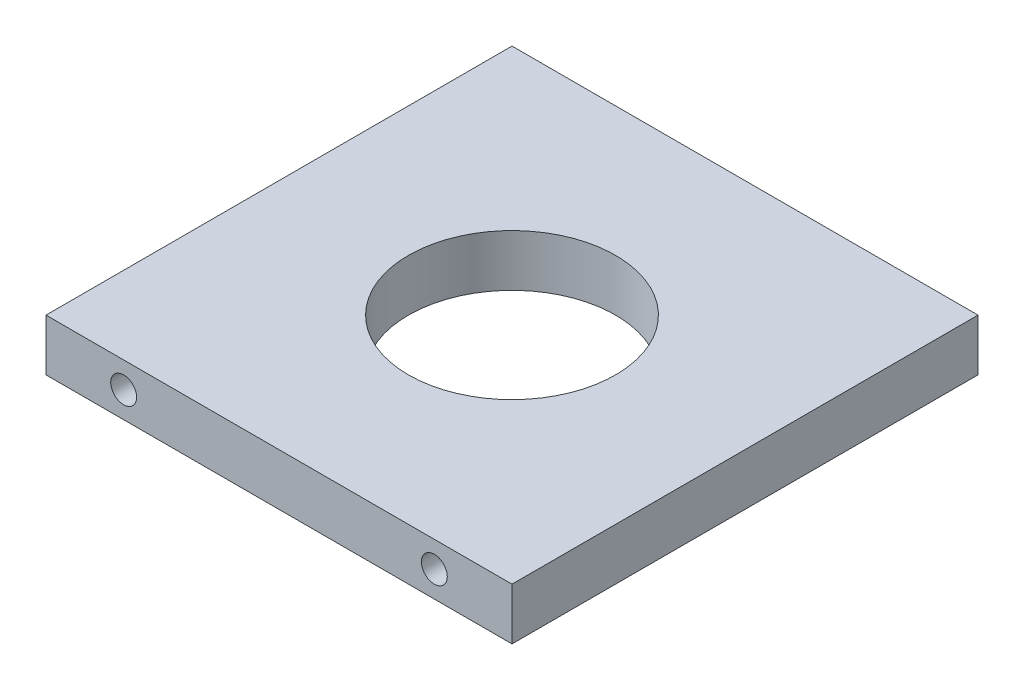
ISO-10303-21;
HEADER;
FILE_DESCRIPTION(('STEP AP214'),'2;1');
FILE_NAME('part.step','',(''),(''),'','','');
FILE_SCHEMA(('AUTOMOTIVE_DESIGN { 1 0 10303 214 1 1 1 1 }'));
ENDSEC;
DATA;
#1=APPLICATION_CONTEXT('core data for automotive mechanical design processes');
#2=APPLICATION_PROTOCOL_DEFINITION('international standard','automotive_design',2000,#1);
#3=PRODUCT_CONTEXT('',#1,'mechanical');
#4=PRODUCT('Part','Part','',(#3));
#5=PRODUCT_RELATED_PRODUCT_CATEGORY('part','',(#4));
#6=PRODUCT_DEFINITION_FORMATION('','',#4);
#7=PRODUCT_DEFINITION_CONTEXT('part definition',#1,'design');
#8=PRODUCT_DEFINITION('design','',#6,#7);
#9=PRODUCT_DEFINITION_SHAPE('','',#8);
#10=(LENGTH_UNIT() NAMED_UNIT(*) SI_UNIT(.MILLI.,.METRE.));
#11=(NAMED_UNIT(*) PLANE_ANGLE_UNIT() SI_UNIT($,.RADIAN.));
#12=(NAMED_UNIT(*) SI_UNIT($,.STERADIAN.) SOLID_ANGLE_UNIT());
#13=UNCERTAINTY_MEASURE_WITH_UNIT(LENGTH_MEASURE(1.E-05),#10,'distance_accuracy_value','');
#14=(GEOMETRIC_REPRESENTATION_CONTEXT(3) GLOBAL_UNCERTAINTY_ASSIGNED_CONTEXT((#13)) GLOBAL_UNIT_ASSIGNED_CONTEXT((#10,
#11,#12)) REPRESENTATION_CONTEXT('',''));
#15=CARTESIAN_POINT('',(0.,0.,0.));
#16=DIRECTION('',(0.,0.,1.));
#17=DIRECTION('',(1.,0.,0.));
#18=AXIS2_PLACEMENT_3D('',#15,#16,#17);
#19=CARTESIAN_POINT('',(0.,6.35,0.));
#20=DIRECTION('',(0.,1.,0.));
#21=DIRECTION('',(0.,0.,1.));
#22=AXIS2_PLACEMENT_3D('',#19,#20,#21);
#23=PLANE('',#22);
#24=DIRECTION('',(0.,0.,1.));
#25=VECTOR('',#24,1.);
#26=CARTESIAN_POINT('',(-28.575,6.35,28.575));
#27=LINE('',#26,#25);
#28=CARTESIAN_POINT('',(-28.575,6.35,-28.575));
#29=VERTEX_POINT('',#28);
#30=CARTESIAN_POINT('',(-28.575,6.35,28.575));
#31=VERTEX_POINT('',#30);
#32=EDGE_CURVE('E84',#29,#31,#27,.T.);
#33=ORIENTED_EDGE('',*,*,#32,.T.);
#34=DIRECTION('',(1.,0.,0.));
#35=VECTOR('',#34,1.);
#36=CARTESIAN_POINT('',(28.575,6.35,28.575));
#37=LINE('',#36,#35);
#38=CARTESIAN_POINT('',(28.575,6.35,28.575));
#39=VERTEX_POINT('',#38);
#40=EDGE_CURVE('E79',#31,#39,#37,.T.);
#41=ORIENTED_EDGE('',*,*,#40,.T.);
#42=DIRECTION('',(0.,0.,-1.));
#43=VECTOR('',#42,1.);
#44=CARTESIAN_POINT('',(28.575,6.35,28.575));
#45=LINE('',#44,#43);
#46=CARTESIAN_POINT('',(28.575,6.35,-28.575));
#47=VERTEX_POINT('',#46);
#48=EDGE_CURVE('E82',#39,#47,#45,.T.);
#49=ORIENTED_EDGE('',*,*,#48,.T.);
#50=DIRECTION('',(-1.,0.,0.));
#51=VECTOR('',#50,1.);
#52=CARTESIAN_POINT('',(28.575,6.35,-28.575));
#53=LINE('',#52,#51);
#54=EDGE_CURVE('E49',#47,#29,#53,.T.);
#55=ORIENTED_EDGE('',*,*,#54,.T.);
#56=EDGE_LOOP('',(#33,#41,#49,#55));
#57=FACE_BOUND('',#56,.T.);
#58=CARTESIAN_POINT('',(0.,6.35,0.));
#59=DIRECTION('',(0.,1.,0.));
#60=DIRECTION('',(0.,0.,1.));
#61=AXIS2_PLACEMENT_3D('',#58,#59,#60);
#62=CIRCLE('',#61,12.7);
#63=CARTESIAN_POINT('',(0.,6.35,12.7));
#64=VERTEX_POINT('',#63);
#65=EDGE_CURVE('E99',#64,#64,#62,.T.);
#66=ORIENTED_EDGE('',*,*,#65,.F.);
#67=EDGE_LOOP('',(#66));
#68=FACE_BOUND('',#67,.T.);
#69=ADVANCED_FACE('F32',(#57,#68),#23,.T.);
#70=CARTESIAN_POINT('',(0.,0.,0.));
#71=DIRECTION('',(0.,1.,0.));
#72=DIRECTION('',(0.,0.,1.));
#73=AXIS2_PLACEMENT_3D('',#70,#71,#72);
#74=PLANE('',#73);
#75=DIRECTION('',(0.,0.,1.));
#76=VECTOR('',#75,1.);
#77=CARTESIAN_POINT('',(-28.575,0.,28.575));
#78=LINE('',#77,#76);
#79=CARTESIAN_POINT('',(-28.575,0.,-28.575));
#80=VERTEX_POINT('',#79);
#81=CARTESIAN_POINT('',(-28.575,0.,28.575));
#82=VERTEX_POINT('',#81);
#83=EDGE_CURVE('E96',#80,#82,#78,.T.);
#84=ORIENTED_EDGE('',*,*,#83,.F.);
#85=DIRECTION('',(-1.,0.,0.));
#86=VECTOR('',#85,1.);
#87=CARTESIAN_POINT('',(28.575,0.,-28.575));
#88=LINE('',#87,#86);
#89=CARTESIAN_POINT('',(28.575,0.,-28.575));
#90=VERTEX_POINT('',#89);
#91=EDGE_CURVE('E72',#90,#80,#88,.T.);
#92=ORIENTED_EDGE('',*,*,#91,.F.);
#93=DIRECTION('',(0.,0.,-1.));
#94=VECTOR('',#93,1.);
#95=CARTESIAN_POINT('',(28.575,0.,28.575));
#96=LINE('',#95,#94);
#97=CARTESIAN_POINT('',(28.575,0.,28.575));
#98=VERTEX_POINT('',#97);
#99=EDGE_CURVE('E66',#98,#90,#96,.T.);
#100=ORIENTED_EDGE('',*,*,#99,.F.);
#101=DIRECTION('',(1.,0.,0.));
#102=VECTOR('',#101,1.);
#103=CARTESIAN_POINT('',(28.575,0.,28.575));
#104=LINE('',#103,#102);
#105=EDGE_CURVE('E88',#82,#98,#104,.T.);
#106=ORIENTED_EDGE('',*,*,#105,.F.);
#107=EDGE_LOOP('',(#84,#92,#100,#106));
#108=FACE_BOUND('',#107,.T.);
#109=CARTESIAN_POINT('',(0.,0.,0.));
#110=DIRECTION('',(0.,1.,0.));
#111=DIRECTION('',(0.,0.,1.));
#112=AXIS2_PLACEMENT_3D('',#109,#110,#111);
#113=CIRCLE('',#112,12.7);
#114=CARTESIAN_POINT('',(0.,0.,12.7));
#115=VERTEX_POINT('',#114);
#116=EDGE_CURVE('E111',#115,#115,#113,.T.);
#117=ORIENTED_EDGE('',*,*,#116,.T.);
#118=EDGE_LOOP('',(#117));
#119=FACE_BOUND('',#118,.T.);
#120=ADVANCED_FACE('F107',(#108,#119),#74,.F.);
#121=CARTESIAN_POINT('',(-28.575,6.35,28.575));
#122=DIRECTION('',(1.,0.,0.));
#123=DIRECTION('',(0.,0.,-1.));
#124=AXIS2_PLACEMENT_3D('',#121,#122,#123);
#125=PLANE('',#124);
#126=ORIENTED_EDGE('',*,*,#83,.T.);
#127=DIRECTION('',(0.,-1.,0.));
#128=VECTOR('',#127,1.);
#129=CARTESIAN_POINT('',(-28.575,6.35,28.575));
#130=LINE('',#129,#128);
#131=EDGE_CURVE('E11',#31,#82,#130,.T.);
#132=ORIENTED_EDGE('',*,*,#131,.F.);
#133=ORIENTED_EDGE('',*,*,#32,.F.);
#134=DIRECTION('',(0.,-1.,0.));
#135=VECTOR('',#134,1.);
#136=CARTESIAN_POINT('',(-28.575,6.35,-28.575));
#137=LINE('',#136,#135);
#138=EDGE_CURVE('E92',#29,#80,#137,.T.);
#139=ORIENTED_EDGE('',*,*,#138,.T.);
#140=EDGE_LOOP('',(#126,#132,#133,#139));
#141=FACE_BOUND('',#140,.T.);
#142=ADVANCED_FACE('F34',(#141),#125,.F.);
#143=CARTESIAN_POINT('',(28.575,6.35,28.575));
#144=DIRECTION('',(0.,0.,-1.));
#145=DIRECTION('',(-1.,0.,0.));
#146=AXIS2_PLACEMENT_3D('',#143,#144,#145);
#147=PLANE('',#146);
#148=CARTESIAN_POINT('',(-19.05,3.175,28.575));
#149=DIRECTION('',(0.,0.,1.));
#150=DIRECTION('',(1.,0.,0.));
#151=AXIS2_PLACEMENT_3D('',#148,#149,#150);
#152=CIRCLE('',#151,1.5875);
#153=CARTESIAN_POINT('',(-17.4625,3.175,28.575));
#154=VERTEX_POINT('',#153);
#155=EDGE_CURVE('E123',#154,#154,#152,.T.);
#156=ORIENTED_EDGE('',*,*,#155,.F.);
#157=EDGE_LOOP('',(#156));
#158=FACE_BOUND('',#157,.T.);
#159=CARTESIAN_POINT('',(19.05,3.175,28.575));
#160=DIRECTION('',(0.,0.,1.));
#161=DIRECTION('',(1.,0.,0.));
#162=AXIS2_PLACEMENT_3D('',#159,#160,#161);
#163=CIRCLE('',#162,1.5875);
#164=CARTESIAN_POINT('',(20.6375,3.175,28.575));
#165=VERTEX_POINT('',#164);
#166=EDGE_CURVE('E117',#165,#165,#163,.T.);
#167=ORIENTED_EDGE('',*,*,#166,.F.);
#168=EDGE_LOOP('',(#167));
#169=FACE_BOUND('',#168,.T.);
#170=ORIENTED_EDGE('',*,*,#105,.T.);
#171=DIRECTION('',(0.,-1.,0.));
#172=VECTOR('',#171,1.);
#173=CARTESIAN_POINT('',(28.575,6.35,28.575));
#174=LINE('',#173,#172);
#175=EDGE_CURVE('E41',#39,#98,#174,.T.);
#176=ORIENTED_EDGE('',*,*,#175,.F.);
#177=ORIENTED_EDGE('',*,*,#40,.F.);
#178=ORIENTED_EDGE('',*,*,#131,.T.);
#179=EDGE_LOOP('',(#170,#176,#177,#178));
#180=FACE_BOUND('',#179,.T.);
#181=ADVANCED_FACE('F87',(#158,#169,#180),#147,.F.);
#182=CARTESIAN_POINT('',(28.575,6.35,28.575));
#183=DIRECTION('',(-1.,0.,0.));
#184=DIRECTION('',(0.,0.,1.));
#185=AXIS2_PLACEMENT_3D('',#182,#183,#184);
#186=PLANE('',#185);
#187=ORIENTED_EDGE('',*,*,#99,.T.);
#188=DIRECTION('',(0.,-1.,0.));
#189=VECTOR('',#188,1.);
#190=CARTESIAN_POINT('',(28.575,6.35,-28.575));
#191=LINE('',#190,#189);
#192=EDGE_CURVE('E89',#47,#90,#191,.T.);
#193=ORIENTED_EDGE('',*,*,#192,.F.);
#194=ORIENTED_EDGE('',*,*,#48,.F.);
#195=ORIENTED_EDGE('',*,*,#175,.T.);
#196=EDGE_LOOP('',(#187,#193,#194,#195));
#197=FACE_BOUND('',#196,.T.);
#198=ADVANCED_FACE('F90',(#197),#186,.F.);
#199=CARTESIAN_POINT('',(28.575,6.35,-28.575));
#200=DIRECTION('',(0.,0.,1.));
#201=DIRECTION('',(1.,0.,0.));
#202=AXIS2_PLACEMENT_3D('',#199,#200,#201);
#203=PLANE('',#202);
#204=ORIENTED_EDGE('',*,*,#91,.T.);
#205=ORIENTED_EDGE('',*,*,#138,.F.);
#206=ORIENTED_EDGE('',*,*,#54,.F.);
#207=ORIENTED_EDGE('',*,*,#192,.T.);
#208=EDGE_LOOP('',(#204,#205,#206,#207));
#209=FACE_BOUND('',#208,.T.);
#210=ADVANCED_FACE('F104',(#209),#203,.F.);
#211=CARTESIAN_POINT('',(0.,6.35,0.));
#212=DIRECTION('',(0.,-1.,0.));
#213=DIRECTION('',(0.,0.,-1.));
#214=AXIS2_PLACEMENT_3D('',#211,#212,#213);
#215=CYLINDRICAL_SURFACE('',#214,12.7);
#216=ORIENTED_EDGE('',*,*,#65,.T.);
#217=EDGE_LOOP('',(#216));
#218=FACE_BOUND('',#217,.T.);
#219=ORIENTED_EDGE('',*,*,#116,.F.);
#220=EDGE_LOOP('',(#219));
#221=FACE_BOUND('',#220,.T.);
#222=ADVANCED_FACE('F144',(#218,#221),#215,.F.);
#223=CARTESIAN_POINT('',(19.05,3.175,15.875));
#224=DIRECTION('',(0.,0.,1.));
#225=DIRECTION('',(1.,0.,0.));
#226=AXIS2_PLACEMENT_3D('',#223,#224,#225);
#227=CYLINDRICAL_SURFACE('',#226,1.5875);
#228=CARTESIAN_POINT('',(19.05,3.175,15.875));
#229=DIRECTION('',(0.,0.,1.));
#230=DIRECTION('',(1.,0.,0.));
#231=AXIS2_PLACEMENT_3D('',#228,#229,#230);
#232=CIRCLE('',#231,1.5875);
#233=CARTESIAN_POINT('',(20.6375,3.175,15.875));
#234=VERTEX_POINT('',#233);
#235=EDGE_CURVE('E120',#234,#234,#232,.T.);
#236=ORIENTED_EDGE('',*,*,#235,.F.);
#237=EDGE_LOOP('',(#236));
#238=FACE_BOUND('',#237,.T.);
#239=ORIENTED_EDGE('',*,*,#166,.T.);
#240=EDGE_LOOP('',(#239));
#241=FACE_BOUND('',#240,.T.);
#242=ADVANCED_FACE('F142',(#238,#241),#227,.F.);
#243=CARTESIAN_POINT('',(19.05,3.175,15.875));
#244=DIRECTION('',(0.,0.,1.));
#245=DIRECTION('',(1.,0.,0.));
#246=AXIS2_PLACEMENT_3D('',#243,#244,#245);
#247=PLANE('',#246);
#248=ORIENTED_EDGE('',*,*,#235,.T.);
#249=EDGE_LOOP('',(#248));
#250=FACE_BOUND('',#249,.T.);
#251=ADVANCED_FACE('F134',(#250),#247,.T.);
#252=CARTESIAN_POINT('',(-19.05,3.175,15.875));
#253=DIRECTION('',(0.,0.,1.));
#254=DIRECTION('',(1.,0.,0.));
#255=AXIS2_PLACEMENT_3D('',#252,#253,#254);
#256=CYLINDRICAL_SURFACE('',#255,1.5875);
#257=CARTESIAN_POINT('',(-19.05,3.175,15.875));
#258=DIRECTION('',(0.,0.,1.));
#259=DIRECTION('',(1.,0.,0.));
#260=AXIS2_PLACEMENT_3D('',#257,#258,#259);
#261=CIRCLE('',#260,1.5875);
#262=CARTESIAN_POINT('',(-17.4625,3.175,15.875));
#263=VERTEX_POINT('',#262);
#264=EDGE_CURVE('E114',#263,#263,#261,.T.);
#265=ORIENTED_EDGE('',*,*,#264,.F.);
#266=EDGE_LOOP('',(#265));
#267=FACE_BOUND('',#266,.T.);
#268=ORIENTED_EDGE('',*,*,#155,.T.);
#269=EDGE_LOOP('',(#268));
#270=FACE_BOUND('',#269,.T.);
#271=ADVANCED_FACE('F131',(#267,#270),#256,.F.);
#272=CARTESIAN_POINT('',(-19.05,3.175,15.875));
#273=DIRECTION('',(0.,0.,1.));
#274=DIRECTION('',(1.,0.,0.));
#275=AXIS2_PLACEMENT_3D('',#272,#273,#274);
#276=PLANE('',#275);
#277=ORIENTED_EDGE('',*,*,#264,.T.);
#278=EDGE_LOOP('',(#277));
#279=FACE_BOUND('',#278,.T.);
#280=ADVANCED_FACE('F129',(#279),#276,.T.);
#281=CLOSED_SHELL('',(#69,#120,#142,#181,#198,#210,#222,#242,#251,#271,#280));
#282=MANIFOLD_SOLID_BREP('B2',#281);
#283=ADVANCED_BREP_SHAPE_REPRESENTATION('',(#18,#282),#14);
#284=SHAPE_DEFINITION_REPRESENTATION(#9,#283);
ENDSEC;
END-ISO-10303-21;
